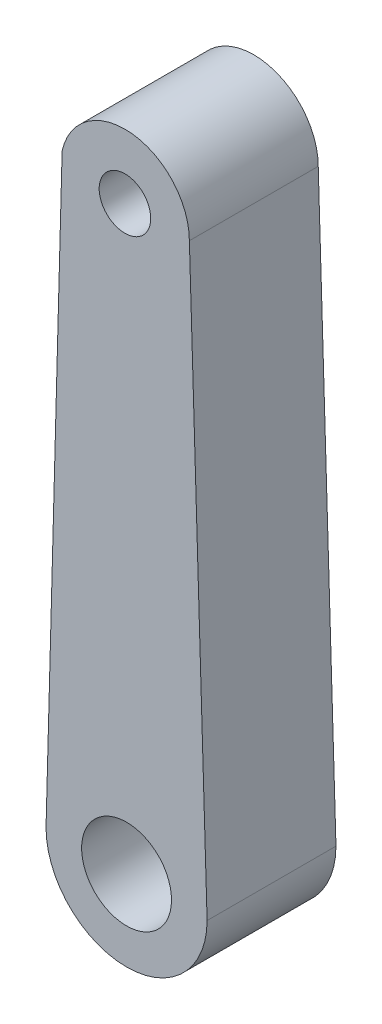
ISO-10303-21;
HEADER;
FILE_DESCRIPTION(('STEP AP214'),'2;1');
FILE_NAME('part.step','',(''),(''),'','','');
FILE_SCHEMA(('AUTOMOTIVE_DESIGN { 1 0 10303 214 1 1 1 1 }'));
ENDSEC;
DATA;
#1=APPLICATION_CONTEXT('core data for automotive mechanical design processes');
#2=APPLICATION_PROTOCOL_DEFINITION('international standard','automotive_design',2000,#1);
#3=PRODUCT_CONTEXT('',#1,'mechanical');
#4=PRODUCT('Part','Part','',(#3));
#5=PRODUCT_RELATED_PRODUCT_CATEGORY('part','',(#4));
#6=PRODUCT_DEFINITION_FORMATION('','',#4);
#7=PRODUCT_DEFINITION_CONTEXT('part definition',#1,'design');
#8=PRODUCT_DEFINITION('design','',#6,#7);
#9=PRODUCT_DEFINITION_SHAPE('','',#8);
#10=(LENGTH_UNIT() NAMED_UNIT(*) SI_UNIT(.MILLI.,.METRE.));
#11=(NAMED_UNIT(*) PLANE_ANGLE_UNIT() SI_UNIT($,.RADIAN.));
#12=(NAMED_UNIT(*) SI_UNIT($,.STERADIAN.) SOLID_ANGLE_UNIT());
#13=UNCERTAINTY_MEASURE_WITH_UNIT(LENGTH_MEASURE(1.E-05),#10,'distance_accuracy_value','');
#14=(GEOMETRIC_REPRESENTATION_CONTEXT(3) GLOBAL_UNCERTAINTY_ASSIGNED_CONTEXT((#13)) GLOBAL_UNIT_ASSIGNED_CONTEXT((#10,
#11,#12)) REPRESENTATION_CONTEXT('',''));
#15=CARTESIAN_POINT('',(0.,0.,0.));
#16=DIRECTION('',(0.,0.,1.));
#17=DIRECTION('',(1.,0.,0.));
#18=AXIS2_PLACEMENT_3D('',#15,#16,#17);
#19=CARTESIAN_POINT('',(0.,0.,10.));
#20=DIRECTION('',(0.,0.,-1.));
#21=DIRECTION('',(-1.,0.,0.));
#22=AXIS2_PLACEMENT_3D('',#19,#20,#21);
#23=CYLINDRICAL_SURFACE('',#22,12.5);
#24=CARTESIAN_POINT('',(0.,0.,-10.));
#25=DIRECTION('',(0.,0.,1.));
#26=DIRECTION('',(1.,0.,0.));
#27=AXIS2_PLACEMENT_3D('',#24,#25,#26);
#28=CIRCLE('',#27,12.5);
#29=CARTESIAN_POINT('',(-12.5,0.,-10.));
#30=VERTEX_POINT('',#29);
#31=CARTESIAN_POINT('',(12.5,0.,-10.));
#32=VERTEX_POINT('',#31);
#33=EDGE_CURVE('E105',#30,#32,#28,.T.);
#34=ORIENTED_EDGE('',*,*,#33,.T.);
#35=DIRECTION('',(0.,0.,-1.));
#36=VECTOR('',#35,1.);
#37=CARTESIAN_POINT('',(12.5,0.,10.));
#38=LINE('',#37,#36);
#39=CARTESIAN_POINT('',(12.5,0.,10.));
#40=VERTEX_POINT('',#39);
#41=EDGE_CURVE('E11',#40,#32,#38,.T.);
#42=ORIENTED_EDGE('',*,*,#41,.F.);
#43=CARTESIAN_POINT('',(0.,0.,10.));
#44=DIRECTION('',(0.,0.,1.));
#45=DIRECTION('',(1.,0.,0.));
#46=AXIS2_PLACEMENT_3D('',#43,#44,#45);
#47=CIRCLE('',#46,12.5);
#48=CARTESIAN_POINT('',(-12.5,0.,10.));
#49=VERTEX_POINT('',#48);
#50=EDGE_CURVE('E93',#49,#40,#47,.T.);
#51=ORIENTED_EDGE('',*,*,#50,.F.);
#52=DIRECTION('',(0.,0.,-1.));
#53=VECTOR('',#52,1.);
#54=CARTESIAN_POINT('',(-12.5,0.,10.));
#55=LINE('',#54,#53);
#56=EDGE_CURVE('E101',#49,#30,#55,.T.);
#57=ORIENTED_EDGE('',*,*,#56,.T.);
#58=EDGE_LOOP('',(#34,#42,#51,#57));
#59=FACE_BOUND('',#58,.T.);
#60=ADVANCED_FACE('F42',(#59),#23,.T.);
#61=CARTESIAN_POINT('',(12.5,0.,10.));
#62=DIRECTION('',(-0.99953263266437,-0.0305698583417314,0.));
#63=DIRECTION('',(0.0305698583417314,-0.99953263266437,0.));
#64=AXIS2_PLACEMENT_3D('',#61,#62,#63);
#65=PLANE('',#64);
#66=DIRECTION('',(-0.0305698583417314,0.99953263266437,0.));
#67=VECTOR('',#66,1.);
#68=CARTESIAN_POINT('',(12.5,0.,-10.));
#69=LINE('',#68,#67);
#70=CARTESIAN_POINT('',(9.74743712456775,89.9996456214909,-10.));
#71=VERTEX_POINT('',#70);
#72=EDGE_CURVE('E97',#32,#71,#69,.T.);
#73=ORIENTED_EDGE('',*,*,#72,.T.);
#74=DIRECTION('',(0.,0.,-1.));
#75=VECTOR('',#74,1.);
#76=CARTESIAN_POINT('',(9.74743712456775,89.9996456214909,10.));
#77=LINE('',#76,#75);
#78=CARTESIAN_POINT('',(9.74743712456775,89.9996456214909,10.));
#79=VERTEX_POINT('',#78);
#80=EDGE_CURVE('E50',#79,#71,#77,.T.);
#81=ORIENTED_EDGE('',*,*,#80,.F.);
#82=DIRECTION('',(-0.0305698583417314,0.99953263266437,0.));
#83=VECTOR('',#82,1.);
#84=CARTESIAN_POINT('',(12.5,0.,10.));
#85=LINE('',#84,#83);
#86=EDGE_CURVE('E88',#40,#79,#85,.T.);
#87=ORIENTED_EDGE('',*,*,#86,.F.);
#88=ORIENTED_EDGE('',*,*,#41,.T.);
#89=EDGE_LOOP('',(#73,#81,#87,#88));
#90=FACE_BOUND('',#89,.T.);
#91=ADVANCED_FACE('F96',(#90),#65,.F.);
#92=CARTESIAN_POINT('',(-0.252562875432245,89.9996456214909,10.));
#93=DIRECTION('',(0.,0.,-1.));
#94=DIRECTION('',(-1.,0.,0.));
#95=AXIS2_PLACEMENT_3D('',#92,#93,#94);
#96=CYLINDRICAL_SURFACE('',#95,10.);
#97=CARTESIAN_POINT('',(-0.252562875432245,89.9996456214909,-10.));
#98=DIRECTION('',(0.,0.,1.));
#99=DIRECTION('',(-1.,0.,0.));
#100=AXIS2_PLACEMENT_3D('',#97,#98,#99);
#101=CIRCLE('',#100,10.);
#102=CARTESIAN_POINT('',(-10.0000000000001,92.2329099369261,-10.));
#103=VERTEX_POINT('',#102);
#104=EDGE_CURVE('E75',#71,#103,#101,.T.);
#105=ORIENTED_EDGE('',*,*,#104,.T.);
#106=DIRECTION('',(0.,0.,-1.));
#107=VECTOR('',#106,1.);
#108=CARTESIAN_POINT('',(-10.0000000000001,92.2329099369261,10.));
#109=LINE('',#108,#107);
#110=CARTESIAN_POINT('',(-10.0000000000001,92.2329099369261,10.));
#111=VERTEX_POINT('',#110);
#112=EDGE_CURVE('E98',#111,#103,#109,.T.);
#113=ORIENTED_EDGE('',*,*,#112,.F.);
#114=CARTESIAN_POINT('',(-0.252562875432245,89.9996456214909,10.));
#115=DIRECTION('',(0.,0.,1.));
#116=DIRECTION('',(-1.,0.,0.));
#117=AXIS2_PLACEMENT_3D('',#114,#115,#116);
#118=CIRCLE('',#117,10.);
#119=EDGE_CURVE('E91',#79,#111,#118,.T.);
#120=ORIENTED_EDGE('',*,*,#119,.F.);
#121=ORIENTED_EDGE('',*,*,#80,.T.);
#122=EDGE_LOOP('',(#105,#113,#120,#121));
#123=FACE_BOUND('',#122,.T.);
#124=ADVANCED_FACE('F99',(#123),#96,.T.);
#125=CARTESIAN_POINT('',(-12.5,0.,10.));
#126=DIRECTION('',(0.999632853853288,-0.0270953408749884,0.));
#127=DIRECTION('',(0.0270953408749884,0.999632853853288,0.));
#128=AXIS2_PLACEMENT_3D('',#125,#126,#127);
#129=PLANE('',#128);
#130=DIRECTION('',(-0.0270953408749884,-0.999632853853288,0.));
#131=VECTOR('',#130,1.);
#132=CARTESIAN_POINT('',(-12.5,0.,-10.));
#133=LINE('',#132,#131);
#134=EDGE_CURVE('E81',#103,#30,#133,.T.);
#135=ORIENTED_EDGE('',*,*,#134,.T.);
#136=ORIENTED_EDGE('',*,*,#56,.F.);
#137=DIRECTION('',(-0.0270953408749884,-0.999632853853288,0.));
#138=VECTOR('',#137,1.);
#139=CARTESIAN_POINT('',(-12.5,0.,10.));
#140=LINE('',#139,#138);
#141=EDGE_CURVE('E58',#111,#49,#140,.T.);
#142=ORIENTED_EDGE('',*,*,#141,.F.);
#143=ORIENTED_EDGE('',*,*,#112,.T.);
#144=EDGE_LOOP('',(#135,#136,#142,#143));
#145=FACE_BOUND('',#144,.T.);
#146=ADVANCED_FACE('F113',(#145),#129,.F.);
#147=CARTESIAN_POINT('',(0.,0.,10.));
#148=DIRECTION('',(0.,0.,1.));
#149=DIRECTION('',(1.,0.,0.));
#150=AXIS2_PLACEMENT_3D('',#147,#148,#149);
#151=PLANE('',#150);
#152=CARTESIAN_POINT('',(0.,0.,10.));
#153=DIRECTION('',(0.,0.,1.));
#154=DIRECTION('',(1.,0.,0.));
#155=AXIS2_PLACEMENT_3D('',#152,#153,#154);
#156=CIRCLE('',#155,6.975);
#157=CARTESIAN_POINT('',(6.975,0.,10.));
#158=VERTEX_POINT('',#157);
#159=EDGE_CURVE('E125',#158,#158,#156,.T.);
#160=ORIENTED_EDGE('',*,*,#159,.F.);
#161=EDGE_LOOP('',(#160));
#162=FACE_BOUND('',#161,.T.);
#163=CARTESIAN_POINT('',(-0.252562875432245,89.9996456214909,10.));
#164=DIRECTION('',(0.,0.,1.));
#165=DIRECTION('',(1.,0.,0.));
#166=AXIS2_PLACEMENT_3D('',#163,#164,#165);
#167=CIRCLE('',#166,4.);
#168=CARTESIAN_POINT('',(3.74743712456776,89.9996456214909,10.));
#169=VERTEX_POINT('',#168);
#170=EDGE_CURVE('E119',#169,#169,#167,.T.);
#171=ORIENTED_EDGE('',*,*,#170,.F.);
#172=EDGE_LOOP('',(#171));
#173=FACE_BOUND('',#172,.T.);
#174=ORIENTED_EDGE('',*,*,#50,.T.);
#175=ORIENTED_EDGE('',*,*,#86,.T.);
#176=ORIENTED_EDGE('',*,*,#119,.T.);
#177=ORIENTED_EDGE('',*,*,#141,.T.);
#178=EDGE_LOOP('',(#174,#175,#176,#177));
#179=FACE_BOUND('',#178,.T.);
#180=ADVANCED_FACE('F89',(#162,#173,#179),#151,.T.);
#181=CARTESIAN_POINT('',(0.,0.,-10.));
#182=DIRECTION('',(0.,0.,1.));
#183=DIRECTION('',(1.,0.,0.));
#184=AXIS2_PLACEMENT_3D('',#181,#182,#183);
#185=PLANE('',#184);
#186=CARTESIAN_POINT('',(0.,0.,-10.));
#187=DIRECTION('',(0.,0.,1.));
#188=DIRECTION('',(1.,0.,0.));
#189=AXIS2_PLACEMENT_3D('',#186,#187,#188);
#190=CIRCLE('',#189,6.975);
#191=CARTESIAN_POINT('',(6.975,0.,-10.));
#192=VERTEX_POINT('',#191);
#193=EDGE_CURVE('E122',#192,#192,#190,.T.);
#194=ORIENTED_EDGE('',*,*,#193,.T.);
#195=EDGE_LOOP('',(#194));
#196=FACE_BOUND('',#195,.T.);
#197=CARTESIAN_POINT('',(-0.252562875432245,89.9996456214909,-10.));
#198=DIRECTION('',(0.,0.,1.));
#199=DIRECTION('',(1.,0.,0.));
#200=AXIS2_PLACEMENT_3D('',#197,#198,#199);
#201=CIRCLE('',#200,4.);
#202=CARTESIAN_POINT('',(3.74743712456776,89.9996456214909,-10.));
#203=VERTEX_POINT('',#202);
#204=EDGE_CURVE('E108',#203,#203,#201,.T.);
#205=ORIENTED_EDGE('',*,*,#204,.T.);
#206=EDGE_LOOP('',(#205));
#207=FACE_BOUND('',#206,.T.);
#208=ORIENTED_EDGE('',*,*,#33,.F.);
#209=ORIENTED_EDGE('',*,*,#134,.F.);
#210=ORIENTED_EDGE('',*,*,#104,.F.);
#211=ORIENTED_EDGE('',*,*,#72,.F.);
#212=EDGE_LOOP('',(#208,#209,#210,#211));
#213=FACE_BOUND('',#212,.T.);
#214=ADVANCED_FACE('F116',(#196,#207,#213),#185,.F.);
#215=CARTESIAN_POINT('',(-0.252562875432245,89.9996456214909,-10.));
#216=DIRECTION('',(0.,0.,1.));
#217=DIRECTION('',(1.,0.,0.));
#218=AXIS2_PLACEMENT_3D('',#215,#216,#217);
#219=CYLINDRICAL_SURFACE('',#218,4.);
#220=ORIENTED_EDGE('',*,*,#204,.F.);
#221=EDGE_LOOP('',(#220));
#222=FACE_BOUND('',#221,.T.);
#223=ORIENTED_EDGE('',*,*,#170,.T.);
#224=EDGE_LOOP('',(#223));
#225=FACE_BOUND('',#224,.T.);
#226=ADVANCED_FACE('F136',(#222,#225),#219,.F.);
#227=CARTESIAN_POINT('',(0.,0.,-10.));
#228=DIRECTION('',(0.,0.,1.));
#229=DIRECTION('',(1.,0.,0.));
#230=AXIS2_PLACEMENT_3D('',#227,#228,#229);
#231=CYLINDRICAL_SURFACE('',#230,6.975);
#232=ORIENTED_EDGE('',*,*,#193,.F.);
#233=EDGE_LOOP('',(#232));
#234=FACE_BOUND('',#233,.T.);
#235=ORIENTED_EDGE('',*,*,#159,.T.);
#236=EDGE_LOOP('',(#235));
#237=FACE_BOUND('',#236,.T.);
#238=ADVANCED_FACE('F133',(#234,#237),#231,.F.);
#239=CLOSED_SHELL('',(#60,#91,#124,#146,#180,#214,#226,#238));
#240=MANIFOLD_SOLID_BREP('B2',#239);
#241=ADVANCED_BREP_SHAPE_REPRESENTATION('',(#18,#240),#14);
#242=SHAPE_DEFINITION_REPRESENTATION(#9,#241);
ENDSEC;
END-ISO-10303-21;
